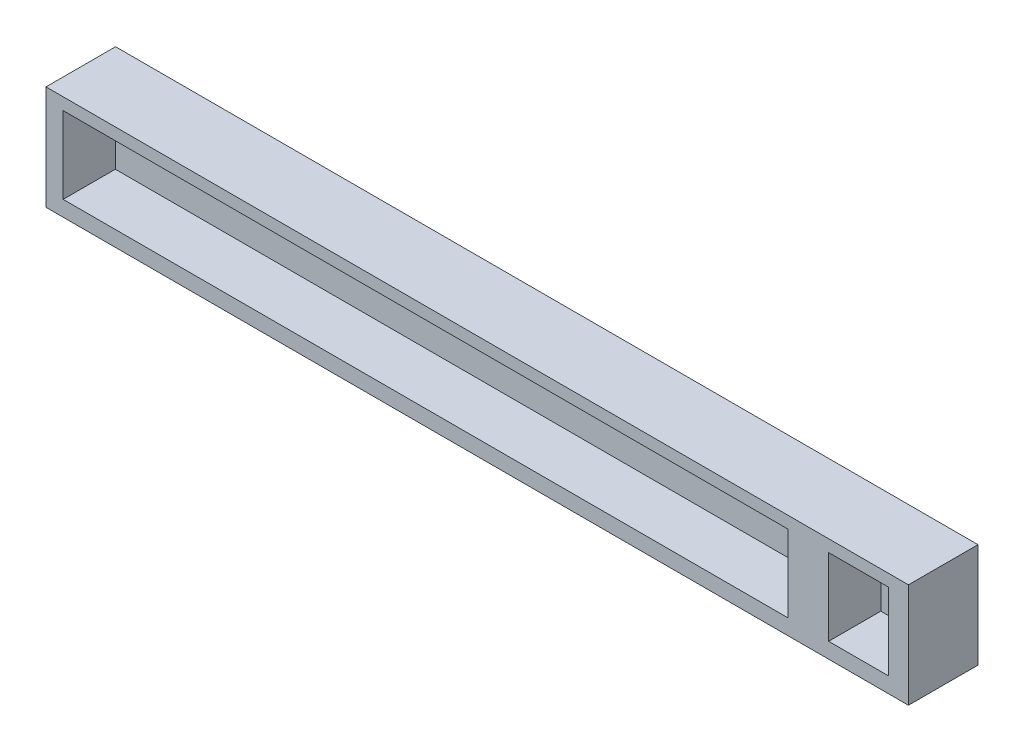
ISO-10303-21;
HEADER;
FILE_DESCRIPTION(('STEP AP214'),'2;1');
FILE_NAME('part.step','',(''),(''),'','','');
FILE_SCHEMA(('AUTOMOTIVE_DESIGN { 1 0 10303 214 1 1 1 1 }'));
ENDSEC;
DATA;
#1=APPLICATION_CONTEXT('core data for automotive mechanical design processes');
#2=APPLICATION_PROTOCOL_DEFINITION('international standard','automotive_design',2000,#1);
#3=PRODUCT_CONTEXT('',#1,'mechanical');
#4=PRODUCT('Part','Part','',(#3));
#5=PRODUCT_RELATED_PRODUCT_CATEGORY('part','',(#4));
#6=PRODUCT_DEFINITION_FORMATION('','',#4);
#7=PRODUCT_DEFINITION_CONTEXT('part definition',#1,'design');
#8=PRODUCT_DEFINITION('design','',#6,#7);
#9=PRODUCT_DEFINITION_SHAPE('','',#8);
#10=(LENGTH_UNIT() NAMED_UNIT(*) SI_UNIT(.MILLI.,.METRE.));
#11=(NAMED_UNIT(*) PLANE_ANGLE_UNIT() SI_UNIT($,.RADIAN.));
#12=(NAMED_UNIT(*) SI_UNIT($,.STERADIAN.) SOLID_ANGLE_UNIT());
#13=UNCERTAINTY_MEASURE_WITH_UNIT(LENGTH_MEASURE(1.E-05),#10,'distance_accuracy_value','');
#14=(GEOMETRIC_REPRESENTATION_CONTEXT(3) GLOBAL_UNCERTAINTY_ASSIGNED_CONTEXT((#13)) GLOBAL_UNIT_ASSIGNED_CONTEXT((#10,
#11,#12)) REPRESENTATION_CONTEXT('',''));
#15=CARTESIAN_POINT('',(0.,0.,0.));
#16=DIRECTION('',(0.,0.,1.));
#17=DIRECTION('',(1.,0.,0.));
#18=AXIS2_PLACEMENT_3D('',#15,#16,#17);
#19=CARTESIAN_POINT('',(0.,0.,20.));
#20=DIRECTION('',(-1.,0.,0.));
#21=DIRECTION('',(0.,0.,1.));
#22=AXIS2_PLACEMENT_3D('',#19,#20,#21);
#23=PLANE('',#22);
#24=DIRECTION('',(0.,1.,0.));
#25=VECTOR('',#24,1.);
#26=CARTESIAN_POINT('',(0.,0.,0.));
#27=LINE('',#26,#25);
#28=CARTESIAN_POINT('',(0.,0.,0.));
#29=VERTEX_POINT('',#28);
#30=CARTESIAN_POINT('',(0.,30.,0.));
#31=VERTEX_POINT('',#30);
#32=EDGE_CURVE('E184',#29,#31,#27,.T.);
#33=ORIENTED_EDGE('',*,*,#32,.F.);
#34=DIRECTION('',(0.,0.,-1.));
#35=VECTOR('',#34,1.);
#36=CARTESIAN_POINT('',(0.,0.,20.));
#37=LINE('',#36,#35);
#38=CARTESIAN_POINT('',(0.,0.,20.));
#39=VERTEX_POINT('',#38);
#40=EDGE_CURVE('E11',#39,#29,#37,.T.);
#41=ORIENTED_EDGE('',*,*,#40,.F.);
#42=DIRECTION('',(0.,1.,0.));
#43=VECTOR('',#42,1.);
#44=CARTESIAN_POINT('',(0.,0.,20.));
#45=LINE('',#44,#43);
#46=CARTESIAN_POINT('',(0.,30.,20.));
#47=VERTEX_POINT('',#46);
#48=EDGE_CURVE('E190',#39,#47,#45,.T.);
#49=ORIENTED_EDGE('',*,*,#48,.T.);
#50=DIRECTION('',(0.,0.,-1.));
#51=VECTOR('',#50,1.);
#52=CARTESIAN_POINT('',(0.,30.,20.));
#53=LINE('',#52,#51);
#54=EDGE_CURVE('E35',#47,#31,#53,.T.);
#55=ORIENTED_EDGE('',*,*,#54,.T.);
#56=EDGE_LOOP('',(#33,#41,#49,#55));
#57=FACE_BOUND('',#56,.T.);
#58=ADVANCED_FACE('F32',(#57),#23,.T.);
#59=CARTESIAN_POINT('',(0.,0.,20.));
#60=DIRECTION('',(0.,1.,0.));
#61=DIRECTION('',(0.,0.,1.));
#62=AXIS2_PLACEMENT_3D('',#59,#60,#61);
#63=PLANE('',#62);
#64=DIRECTION('',(1.,0.,0.));
#65=VECTOR('',#64,1.);
#66=CARTESIAN_POINT('',(0.,0.,0.));
#67=LINE('',#66,#65);
#68=CARTESIAN_POINT('',(248.,0.,0.));
#69=VERTEX_POINT('',#68);
#70=EDGE_CURVE('E194',#29,#69,#67,.T.);
#71=ORIENTED_EDGE('',*,*,#70,.T.);
#72=DIRECTION('',(0.,0.,-1.));
#73=VECTOR('',#72,1.);
#74=CARTESIAN_POINT('',(248.,0.,20.));
#75=LINE('',#74,#73);
#76=CARTESIAN_POINT('',(248.,0.,20.));
#77=VERTEX_POINT('',#76);
#78=EDGE_CURVE('E40',#77,#69,#75,.T.);
#79=ORIENTED_EDGE('',*,*,#78,.F.);
#80=DIRECTION('',(1.,0.,0.));
#81=VECTOR('',#80,1.);
#82=CARTESIAN_POINT('',(0.,0.,20.));
#83=LINE('',#82,#81);
#84=EDGE_CURVE('E199',#39,#77,#83,.T.);
#85=ORIENTED_EDGE('',*,*,#84,.F.);
#86=ORIENTED_EDGE('',*,*,#40,.T.);
#87=EDGE_LOOP('',(#71,#79,#85,#86));
#88=FACE_BOUND('',#87,.T.);
#89=ADVANCED_FACE('F226',(#88),#63,.F.);
#90=CARTESIAN_POINT('',(248.,0.,20.));
#91=DIRECTION('',(-1.,0.,0.));
#92=DIRECTION('',(0.,0.,1.));
#93=AXIS2_PLACEMENT_3D('',#90,#91,#92);
#94=PLANE('',#93);
#95=DIRECTION('',(0.,1.,0.));
#96=VECTOR('',#95,1.);
#97=CARTESIAN_POINT('',(248.,0.,0.));
#98=LINE('',#97,#96);
#99=CARTESIAN_POINT('',(248.,30.,0.));
#100=VERTEX_POINT('',#99);
#101=EDGE_CURVE('E206',#69,#100,#98,.T.);
#102=ORIENTED_EDGE('',*,*,#101,.T.);
#103=DIRECTION('',(0.,0.,-1.));
#104=VECTOR('',#103,1.);
#105=CARTESIAN_POINT('',(248.,30.,20.));
#106=LINE('',#105,#104);
#107=CARTESIAN_POINT('',(248.,30.,20.));
#108=VERTEX_POINT('',#107);
#109=EDGE_CURVE('E211',#108,#100,#106,.T.);
#110=ORIENTED_EDGE('',*,*,#109,.F.);
#111=DIRECTION('',(0.,1.,0.));
#112=VECTOR('',#111,1.);
#113=CARTESIAN_POINT('',(248.,0.,20.));
#114=LINE('',#113,#112);
#115=EDGE_CURVE('E197',#77,#108,#114,.T.);
#116=ORIENTED_EDGE('',*,*,#115,.F.);
#117=ORIENTED_EDGE('',*,*,#78,.T.);
#118=EDGE_LOOP('',(#102,#110,#116,#117));
#119=FACE_BOUND('',#118,.T.);
#120=ADVANCED_FACE('F230',(#119),#94,.F.);
#121=CARTESIAN_POINT('',(0.,30.,20.));
#122=DIRECTION('',(0.,1.,0.));
#123=DIRECTION('',(0.,0.,1.));
#124=AXIS2_PLACEMENT_3D('',#121,#122,#123);
#125=PLANE('',#124);
#126=DIRECTION('',(1.,0.,0.));
#127=VECTOR('',#126,1.);
#128=CARTESIAN_POINT('',(0.,30.,0.));
#129=LINE('',#128,#127);
#130=EDGE_CURVE('E203',#31,#100,#129,.T.);
#131=ORIENTED_EDGE('',*,*,#130,.F.);
#132=ORIENTED_EDGE('',*,*,#54,.F.);
#133=DIRECTION('',(1.,0.,0.));
#134=VECTOR('',#133,1.);
#135=CARTESIAN_POINT('',(0.,30.,20.));
#136=LINE('',#135,#134);
#137=EDGE_CURVE('E193',#47,#108,#136,.T.);
#138=ORIENTED_EDGE('',*,*,#137,.T.);
#139=ORIENTED_EDGE('',*,*,#109,.T.);
#140=EDGE_LOOP('',(#131,#132,#138,#139));
#141=FACE_BOUND('',#140,.T.);
#142=ADVANCED_FACE('F219',(#141),#125,.T.);
#143=CARTESIAN_POINT('',(0.,0.,20.));
#144=DIRECTION('',(0.,0.,-1.));
#145=DIRECTION('',(-1.,0.,0.));
#146=AXIS2_PLACEMENT_3D('',#143,#144,#145);
#147=PLANE('',#146);
#148=DIRECTION('',(-1.,0.,0.));
#149=VECTOR('',#148,1.);
#150=CARTESIAN_POINT('',(213.430430905067,26.5596628139409,20.));
#151=LINE('',#150,#149);
#152=CARTESIAN_POINT('',(213.430430905067,26.5596628139409,20.));
#153=VERTEX_POINT('',#152);
#154=CARTESIAN_POINT('',(4.93739485482969,26.5596628139409,20.));
#155=VERTEX_POINT('',#154);
#156=EDGE_CURVE('E150',#153,#155,#151,.T.);
#157=ORIENTED_EDGE('',*,*,#156,.F.);
#158=DIRECTION('',(0.,1.,0.));
#159=VECTOR('',#158,1.);
#160=CARTESIAN_POINT('',(213.430430905067,26.5596628139409,20.));
#161=LINE('',#160,#159);
#162=CARTESIAN_POINT('',(213.430430905067,4.45577626158491,20.));
#163=VERTEX_POINT('',#162);
#164=EDGE_CURVE('E48',#163,#153,#161,.T.);
#165=ORIENTED_EDGE('',*,*,#164,.F.);
#166=DIRECTION('',(1.,0.,0.));
#167=VECTOR('',#166,1.);
#168=CARTESIAN_POINT('',(213.430430905067,4.45577626158491,20.));
#169=LINE('',#168,#167);
#170=CARTESIAN_POINT('',(4.93739485482969,4.45577626158491,20.));
#171=VERTEX_POINT('',#170);
#172=EDGE_CURVE('E141',#171,#163,#169,.T.);
#173=ORIENTED_EDGE('',*,*,#172,.F.);
#174=DIRECTION('',(0.,-1.,0.));
#175=VECTOR('',#174,1.);
#176=CARTESIAN_POINT('',(4.93739485482969,26.5596628139409,20.));
#177=LINE('',#176,#175);
#178=EDGE_CURVE('E144',#155,#171,#177,.T.);
#179=ORIENTED_EDGE('',*,*,#178,.F.);
#180=EDGE_LOOP('',(#157,#165,#173,#179));
#181=FACE_BOUND('',#180,.T.);
#182=DIRECTION('',(-1.,0.,0.));
#183=VECTOR('',#182,1.);
#184=CARTESIAN_POINT('',(242.270574185585,26.5596628139409,20.));
#185=LINE('',#184,#183);
#186=CARTESIAN_POINT('',(242.270574185585,26.5596628139409,20.));
#187=VERTEX_POINT('',#186);
#188=CARTESIAN_POINT('',(225.04676648245,26.5596628139409,20.));
#189=VERTEX_POINT('',#188);
#190=EDGE_CURVE('E174',#187,#189,#185,.T.);
#191=ORIENTED_EDGE('',*,*,#190,.F.);
#192=DIRECTION('',(0.,1.,0.));
#193=VECTOR('',#192,1.);
#194=CARTESIAN_POINT('',(242.270574185585,26.5596628139409,20.));
#195=LINE('',#194,#193);
#196=CARTESIAN_POINT('',(242.270574185585,4.45577626158491,20.));
#197=VERTEX_POINT('',#196);
#198=EDGE_CURVE('E56',#197,#187,#195,.T.);
#199=ORIENTED_EDGE('',*,*,#198,.F.);
#200=DIRECTION('',(1.,0.,0.));
#201=VECTOR('',#200,1.);
#202=CARTESIAN_POINT('',(242.270574185585,4.45577626158491,20.));
#203=LINE('',#202,#201);
#204=CARTESIAN_POINT('',(225.04676648245,4.45577626158491,20.));
#205=VERTEX_POINT('',#204);
#206=EDGE_CURVE('E163',#205,#197,#203,.T.);
#207=ORIENTED_EDGE('',*,*,#206,.F.);
#208=DIRECTION('',(0.,-1.,0.));
#209=VECTOR('',#208,1.);
#210=CARTESIAN_POINT('',(225.04676648245,26.5596628139409,20.));
#211=LINE('',#210,#209);
#212=EDGE_CURVE('E177',#189,#205,#211,.T.);
#213=ORIENTED_EDGE('',*,*,#212,.F.);
#214=EDGE_LOOP('',(#191,#199,#207,#213));
#215=FACE_BOUND('',#214,.T.);
#216=ORIENTED_EDGE('',*,*,#48,.F.);
#217=ORIENTED_EDGE('',*,*,#84,.T.);
#218=ORIENTED_EDGE('',*,*,#115,.T.);
#219=ORIENTED_EDGE('',*,*,#137,.F.);
#220=EDGE_LOOP('',(#216,#217,#218,#219));
#221=FACE_BOUND('',#220,.T.);
#222=ADVANCED_FACE('F232',(#181,#215,#221),#147,.F.);
#223=CARTESIAN_POINT('',(0.,0.,0.));
#224=DIRECTION('',(0.,0.,-1.));
#225=DIRECTION('',(-1.,0.,0.));
#226=AXIS2_PLACEMENT_3D('',#223,#224,#225);
#227=PLANE('',#226);
#228=ORIENTED_EDGE('',*,*,#32,.T.);
#229=ORIENTED_EDGE('',*,*,#130,.T.);
#230=ORIENTED_EDGE('',*,*,#101,.F.);
#231=ORIENTED_EDGE('',*,*,#70,.F.);
#232=EDGE_LOOP('',(#228,#229,#230,#231));
#233=FACE_BOUND('',#232,.T.);
#234=ADVANCED_FACE('F223',(#233),#227,.T.);
#235=CARTESIAN_POINT('',(242.270574185585,26.5596628139409,5.));
#236=DIRECTION('',(1.,0.,0.));
#237=DIRECTION('',(0.,0.,-1.));
#238=AXIS2_PLACEMENT_3D('',#235,#236,#237);
#239=PLANE('',#238);
#240=ORIENTED_EDGE('',*,*,#198,.T.);
#241=DIRECTION('',(0.,0.,1.));
#242=VECTOR('',#241,1.);
#243=CARTESIAN_POINT('',(242.270574185585,26.5596628139409,5.));
#244=LINE('',#243,#242);
#245=CARTESIAN_POINT('',(242.270574185585,26.5596628139409,5.));
#246=VERTEX_POINT('',#245);
#247=EDGE_CURVE('E172',#246,#187,#244,.T.);
#248=ORIENTED_EDGE('',*,*,#247,.F.);
#249=DIRECTION('',(0.,1.,0.));
#250=VECTOR('',#249,1.);
#251=CARTESIAN_POINT('',(242.270574185585,26.5596628139409,5.));
#252=LINE('',#251,#250);
#253=CARTESIAN_POINT('',(242.270574185585,4.45577626158491,5.));
#254=VERTEX_POINT('',#253);
#255=EDGE_CURVE('E159',#254,#246,#252,.T.);
#256=ORIENTED_EDGE('',*,*,#255,.F.);
#257=DIRECTION('',(0.,0.,1.));
#258=VECTOR('',#257,1.);
#259=CARTESIAN_POINT('',(242.270574185585,4.45577626158491,5.));
#260=LINE('',#259,#258);
#261=EDGE_CURVE('E182',#254,#197,#260,.T.);
#262=ORIENTED_EDGE('',*,*,#261,.T.);
#263=EDGE_LOOP('',(#240,#248,#256,#262));
#264=FACE_BOUND('',#263,.T.);
#265=ADVANCED_FACE('F240',(#264),#239,.F.);
#266=CARTESIAN_POINT('',(242.270574185585,4.45577626158491,5.));
#267=DIRECTION('',(0.,-1.,0.));
#268=DIRECTION('',(0.,0.,-1.));
#269=AXIS2_PLACEMENT_3D('',#266,#267,#268);
#270=PLANE('',#269);
#271=ORIENTED_EDGE('',*,*,#206,.T.);
#272=ORIENTED_EDGE('',*,*,#261,.F.);
#273=DIRECTION('',(1.,0.,0.));
#274=VECTOR('',#273,1.);
#275=CARTESIAN_POINT('',(242.270574185585,4.45577626158491,5.));
#276=LINE('',#275,#274);
#277=CARTESIAN_POINT('',(225.04676648245,4.45577626158491,5.));
#278=VERTEX_POINT('',#277);
#279=EDGE_CURVE('E169',#278,#254,#276,.T.);
#280=ORIENTED_EDGE('',*,*,#279,.F.);
#281=DIRECTION('',(0.,0.,1.));
#282=VECTOR('',#281,1.);
#283=CARTESIAN_POINT('',(225.04676648245,4.45577626158491,5.));
#284=LINE('',#283,#282);
#285=EDGE_CURVE('E185',#278,#205,#284,.T.);
#286=ORIENTED_EDGE('',*,*,#285,.T.);
#287=EDGE_LOOP('',(#271,#272,#280,#286));
#288=FACE_BOUND('',#287,.T.);
#289=ADVANCED_FACE('F278',(#288),#270,.F.);
#290=CARTESIAN_POINT('',(225.04676648245,26.5596628139409,5.));
#291=DIRECTION('',(-1.,0.,0.));
#292=DIRECTION('',(0.,0.,1.));
#293=AXIS2_PLACEMENT_3D('',#290,#291,#292);
#294=PLANE('',#293);
#295=ORIENTED_EDGE('',*,*,#212,.T.);
#296=ORIENTED_EDGE('',*,*,#285,.F.);
#297=DIRECTION('',(0.,-1.,0.));
#298=VECTOR('',#297,1.);
#299=CARTESIAN_POINT('',(225.04676648245,26.5596628139409,5.));
#300=LINE('',#299,#298);
#301=CARTESIAN_POINT('',(225.04676648245,26.5596628139409,5.));
#302=VERTEX_POINT('',#301);
#303=EDGE_CURVE('E166',#302,#278,#300,.T.);
#304=ORIENTED_EDGE('',*,*,#303,.F.);
#305=DIRECTION('',(0.,0.,1.));
#306=VECTOR('',#305,1.);
#307=CARTESIAN_POINT('',(225.04676648245,26.5596628139409,5.));
#308=LINE('',#307,#306);
#309=EDGE_CURVE('E187',#302,#189,#308,.T.);
#310=ORIENTED_EDGE('',*,*,#309,.T.);
#311=EDGE_LOOP('',(#295,#296,#304,#310));
#312=FACE_BOUND('',#311,.T.);
#313=ADVANCED_FACE('F286',(#312),#294,.F.);
#314=CARTESIAN_POINT('',(242.270574185585,26.5596628139409,5.));
#315=DIRECTION('',(0.,1.,0.));
#316=DIRECTION('',(0.,0.,1.));
#317=AXIS2_PLACEMENT_3D('',#314,#315,#316);
#318=PLANE('',#317);
#319=ORIENTED_EDGE('',*,*,#190,.T.);
#320=ORIENTED_EDGE('',*,*,#309,.F.);
#321=DIRECTION('',(-1.,0.,0.));
#322=VECTOR('',#321,1.);
#323=CARTESIAN_POINT('',(242.270574185585,26.5596628139409,5.));
#324=LINE('',#323,#322);
#325=EDGE_CURVE('E162',#246,#302,#324,.T.);
#326=ORIENTED_EDGE('',*,*,#325,.F.);
#327=ORIENTED_EDGE('',*,*,#247,.T.);
#328=EDGE_LOOP('',(#319,#320,#326,#327));
#329=FACE_BOUND('',#328,.T.);
#330=ADVANCED_FACE('F296',(#329),#318,.F.);
#331=CARTESIAN_POINT('',(0.,0.,5.));
#332=DIRECTION('',(0.,0.,-1.));
#333=DIRECTION('',(-1.,0.,0.));
#334=AXIS2_PLACEMENT_3D('',#331,#332,#333);
#335=PLANE('',#334);
#336=ORIENTED_EDGE('',*,*,#255,.T.);
#337=ORIENTED_EDGE('',*,*,#325,.T.);
#338=ORIENTED_EDGE('',*,*,#303,.T.);
#339=ORIENTED_EDGE('',*,*,#279,.T.);
#340=EDGE_LOOP('',(#336,#337,#338,#339));
#341=FACE_BOUND('',#340,.T.);
#342=ADVANCED_FACE('F306',(#341),#335,.F.);
#343=CARTESIAN_POINT('',(213.430430905067,26.5596628139409,5.));
#344=DIRECTION('',(1.,0.,0.));
#345=DIRECTION('',(0.,0.,-1.));
#346=AXIS2_PLACEMENT_3D('',#343,#344,#345);
#347=PLANE('',#346);
#348=ORIENTED_EDGE('',*,*,#164,.T.);
#349=DIRECTION('',(0.,0.,1.));
#350=VECTOR('',#349,1.);
#351=CARTESIAN_POINT('',(213.430430905067,26.5596628139409,5.));
#352=LINE('',#351,#350);
#353=CARTESIAN_POINT('',(213.430430905067,26.5596628139409,5.));
#354=VERTEX_POINT('',#353);
#355=EDGE_CURVE('E119',#354,#153,#352,.T.);
#356=ORIENTED_EDGE('',*,*,#355,.F.);
#357=DIRECTION('',(0.,1.,0.));
#358=VECTOR('',#357,1.);
#359=CARTESIAN_POINT('',(213.430430905067,26.5596628139409,5.));
#360=LINE('',#359,#358);
#361=CARTESIAN_POINT('',(213.430430905067,4.45577626158491,5.));
#362=VERTEX_POINT('',#361);
#363=EDGE_CURVE('E123',#362,#354,#360,.T.);
#364=ORIENTED_EDGE('',*,*,#363,.F.);
#365=DIRECTION('',(0.,0.,1.));
#366=VECTOR('',#365,1.);
#367=CARTESIAN_POINT('',(213.430430905067,4.45577626158491,5.));
#368=LINE('',#367,#366);
#369=EDGE_CURVE('E154',#362,#163,#368,.T.);
#370=ORIENTED_EDGE('',*,*,#369,.T.);
#371=EDGE_LOOP('',(#348,#356,#364,#370));
#372=FACE_BOUND('',#371,.T.);
#373=ADVANCED_FACE('F121',(#372),#347,.F.);
#374=CARTESIAN_POINT('',(213.430430905067,4.45577626158491,5.));
#375=DIRECTION('',(0.,-1.,0.));
#376=DIRECTION('',(0.,0.,-1.));
#377=AXIS2_PLACEMENT_3D('',#374,#375,#376);
#378=PLANE('',#377);
#379=ORIENTED_EDGE('',*,*,#172,.T.);
#380=ORIENTED_EDGE('',*,*,#369,.F.);
#381=DIRECTION('',(1.,0.,0.));
#382=VECTOR('',#381,1.);
#383=CARTESIAN_POINT('',(213.430430905067,4.45577626158491,5.));
#384=LINE('',#383,#382);
#385=CARTESIAN_POINT('',(4.93739485482969,4.45577626158491,5.));
#386=VERTEX_POINT('',#385);
#387=EDGE_CURVE('E129',#386,#362,#384,.T.);
#388=ORIENTED_EDGE('',*,*,#387,.F.);
#389=DIRECTION('',(0.,0.,1.));
#390=VECTOR('',#389,1.);
#391=CARTESIAN_POINT('',(4.93739485482969,4.45577626158491,5.));
#392=LINE('',#391,#390);
#393=EDGE_CURVE('E156',#386,#171,#392,.T.);
#394=ORIENTED_EDGE('',*,*,#393,.T.);
#395=EDGE_LOOP('',(#379,#380,#388,#394));
#396=FACE_BOUND('',#395,.T.);
#397=ADVANCED_FACE('F325',(#396),#378,.F.);
#398=CARTESIAN_POINT('',(4.93739485482969,26.5596628139409,5.));
#399=DIRECTION('',(-1.,0.,0.));
#400=DIRECTION('',(0.,0.,1.));
#401=AXIS2_PLACEMENT_3D('',#398,#399,#400);
#402=PLANE('',#401);
#403=ORIENTED_EDGE('',*,*,#178,.T.);
#404=ORIENTED_EDGE('',*,*,#393,.F.);
#405=DIRECTION('',(0.,-1.,0.));
#406=VECTOR('',#405,1.);
#407=CARTESIAN_POINT('',(4.93739485482969,26.5596628139409,5.));
#408=LINE('',#407,#406);
#409=CARTESIAN_POINT('',(4.93739485482969,26.5596628139409,5.));
#410=VERTEX_POINT('',#409);
#411=EDGE_CURVE('E137',#410,#386,#408,.T.);
#412=ORIENTED_EDGE('',*,*,#411,.F.);
#413=DIRECTION('',(0.,0.,1.));
#414=VECTOR('',#413,1.);
#415=CARTESIAN_POINT('',(4.93739485482969,26.5596628139409,5.));
#416=LINE('',#415,#414);
#417=EDGE_CURVE('E128',#410,#155,#416,.T.);
#418=ORIENTED_EDGE('',*,*,#417,.T.);
#419=EDGE_LOOP('',(#403,#404,#412,#418));
#420=FACE_BOUND('',#419,.T.);
#421=ADVANCED_FACE('F334',(#420),#402,.F.);
#422=CARTESIAN_POINT('',(213.430430905067,26.5596628139409,5.));
#423=DIRECTION('',(0.,1.,0.));
#424=DIRECTION('',(0.,0.,1.));
#425=AXIS2_PLACEMENT_3D('',#422,#423,#424);
#426=PLANE('',#425);
#427=ORIENTED_EDGE('',*,*,#156,.T.);
#428=ORIENTED_EDGE('',*,*,#417,.F.);
#429=DIRECTION('',(-1.,0.,0.));
#430=VECTOR('',#429,1.);
#431=CARTESIAN_POINT('',(213.430430905067,26.5596628139409,5.));
#432=LINE('',#431,#430);
#433=EDGE_CURVE('E132',#354,#410,#432,.T.);
#434=ORIENTED_EDGE('',*,*,#433,.F.);
#435=ORIENTED_EDGE('',*,*,#355,.T.);
#436=EDGE_LOOP('',(#427,#428,#434,#435));
#437=FACE_BOUND('',#436,.T.);
#438=ADVANCED_FACE('F133',(#437),#426,.F.);
#439=CARTESIAN_POINT('',(0.,0.,5.));
#440=DIRECTION('',(0.,0.,-1.));
#441=DIRECTION('',(-1.,0.,0.));
#442=AXIS2_PLACEMENT_3D('',#439,#440,#441);
#443=PLANE('',#442);
#444=ORIENTED_EDGE('',*,*,#363,.T.);
#445=ORIENTED_EDGE('',*,*,#433,.T.);
#446=ORIENTED_EDGE('',*,*,#411,.T.);
#447=ORIENTED_EDGE('',*,*,#387,.T.);
#448=EDGE_LOOP('',(#444,#445,#446,#447));
#449=FACE_BOUND('',#448,.T.);
#450=ADVANCED_FACE('F139',(#449),#443,.F.);
#451=CLOSED_SHELL('',(#58,#89,#120,#142,#222,#234,#265,#289,#313,#330,#342,#373,#397,#421,#438,#450));
#452=MANIFOLD_SOLID_BREP('B2',#451);
#453=ADVANCED_BREP_SHAPE_REPRESENTATION('',(#18,#452),#14);
#454=SHAPE_DEFINITION_REPRESENTATION(#9,#453);
ENDSEC;
END-ISO-10303-21;
